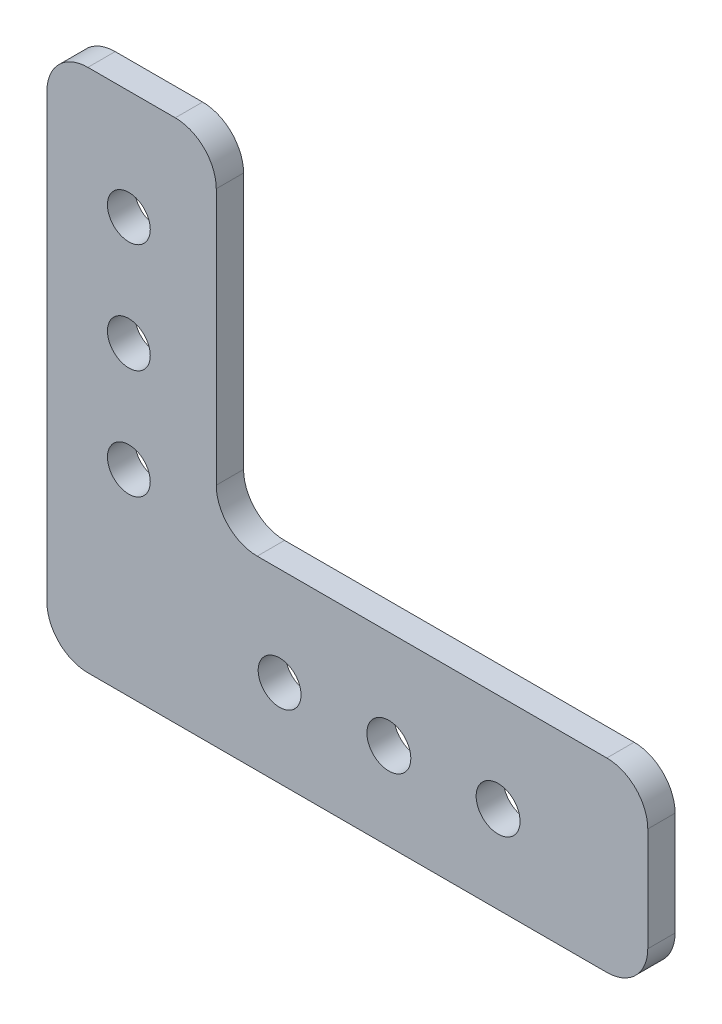
ISO-10303-21;
HEADER;
FILE_DESCRIPTION(('STEP AP214'),'2;1');
FILE_NAME('part.step','',(''),(''),'','','');
FILE_SCHEMA(('AUTOMOTIVE_DESIGN { 1 0 10303 214 1 1 1 1 }'));
ENDSEC;
DATA;
#1=APPLICATION_CONTEXT('core data for automotive mechanical design processes');
#2=APPLICATION_PROTOCOL_DEFINITION('international standard','automotive_design',2000,#1);
#3=PRODUCT_CONTEXT('',#1,'mechanical');
#4=PRODUCT('Part','Part','',(#3));
#5=PRODUCT_RELATED_PRODUCT_CATEGORY('part','',(#4));
#6=PRODUCT_DEFINITION_FORMATION('','',#4);
#7=PRODUCT_DEFINITION_CONTEXT('part definition',#1,'design');
#8=PRODUCT_DEFINITION('design','',#6,#7);
#9=PRODUCT_DEFINITION_SHAPE('','',#8);
#10=(LENGTH_UNIT() NAMED_UNIT(*) SI_UNIT(.MILLI.,.METRE.));
#11=(NAMED_UNIT(*) PLANE_ANGLE_UNIT() SI_UNIT($,.RADIAN.));
#12=(NAMED_UNIT(*) SI_UNIT($,.STERADIAN.) SOLID_ANGLE_UNIT());
#13=UNCERTAINTY_MEASURE_WITH_UNIT(LENGTH_MEASURE(1.E-05),#10,'distance_accuracy_value','');
#14=(GEOMETRIC_REPRESENTATION_CONTEXT(3) GLOBAL_UNCERTAINTY_ASSIGNED_CONTEXT((#13)) GLOBAL_UNIT_ASSIGNED_CONTEXT((#10,
#11,#12)) REPRESENTATION_CONTEXT('',''));
#15=CARTESIAN_POINT('',(0.,0.,0.));
#16=DIRECTION('',(0.,0.,1.));
#17=DIRECTION('',(1.,0.,0.));
#18=AXIS2_PLACEMENT_3D('',#15,#16,#17);
#19=CARTESIAN_POINT('',(-34.925,0.,3.175));
#20=DIRECTION('',(-1.,0.,0.));
#21=DIRECTION('',(0.,0.,1.));
#22=AXIS2_PLACEMENT_3D('',#19,#20,#21);
#23=PLANE('',#22);
#24=DIRECTION('',(0.,1.,0.));
#25=VECTOR('',#24,1.);
#26=CARTESIAN_POINT('',(-34.925,0.,3.175));
#27=LINE('',#26,#25);
#28=CARTESIAN_POINT('',(-34.925,-24.4475,3.175));
#29=VERTEX_POINT('',#28);
#30=CARTESIAN_POINT('',(-34.925,26.9875,3.175));
#31=VERTEX_POINT('',#30);
#32=EDGE_CURVE('E279',#29,#31,#27,.T.);
#33=ORIENTED_EDGE('',*,*,#32,.T.);
#34=DIRECTION('',(0.,0.,-1.));
#35=VECTOR('',#34,1.);
#36=CARTESIAN_POINT('',(-34.925,26.9875,3.175));
#37=LINE('',#36,#35);
#38=CARTESIAN_POINT('',(-34.925,26.9875,0.));
#39=VERTEX_POINT('',#38);
#40=EDGE_CURVE('E192',#31,#39,#37,.T.);
#41=ORIENTED_EDGE('',*,*,#40,.T.);
#42=DIRECTION('',(0.,1.,0.));
#43=VECTOR('',#42,1.);
#44=CARTESIAN_POINT('',(-34.925,0.,0.));
#45=LINE('',#44,#43);
#46=CARTESIAN_POINT('',(-34.925,-24.4475,0.));
#47=VERTEX_POINT('',#46);
#48=EDGE_CURVE('E315',#47,#39,#45,.T.);
#49=ORIENTED_EDGE('',*,*,#48,.F.);
#50=DIRECTION('',(0.,0.,-1.));
#51=VECTOR('',#50,1.);
#52=CARTESIAN_POINT('',(-34.925,-24.4475,3.175));
#53=LINE('',#52,#51);
#54=EDGE_CURVE('E190',#47,#29,#53,.F.);
#55=ORIENTED_EDGE('',*,*,#54,.T.);
#56=EDGE_LOOP('',(#33,#41,#49,#55));
#57=FACE_BOUND('',#56,.T.);
#58=ADVANCED_FACE('F38',(#57),#23,.T.);
#59=CARTESIAN_POINT('',(0.,-29.21,3.175));
#60=DIRECTION('',(0.,1.,0.));
#61=DIRECTION('',(0.,0.,1.));
#62=AXIS2_PLACEMENT_3D('',#59,#60,#61);
#63=PLANE('',#62);
#64=DIRECTION('',(1.,0.,0.));
#65=VECTOR('',#64,1.);
#66=CARTESIAN_POINT('',(0.,-29.21,0.));
#67=LINE('',#66,#65);
#68=CARTESIAN_POINT('',(-30.1625,-29.21,0.));
#69=VERTEX_POINT('',#68);
#70=CARTESIAN_POINT('',(30.1625,-29.21,0.));
#71=VERTEX_POINT('',#70);
#72=EDGE_CURVE('E162',#69,#71,#67,.T.);
#73=ORIENTED_EDGE('',*,*,#72,.T.);
#74=DIRECTION('',(0.,0.,-1.));
#75=VECTOR('',#74,1.);
#76=CARTESIAN_POINT('',(30.1625,-29.21,3.175));
#77=LINE('',#76,#75);
#78=CARTESIAN_POINT('',(30.1625,-29.21,3.175));
#79=VERTEX_POINT('',#78);
#80=EDGE_CURVE('E53',#71,#79,#77,.F.);
#81=ORIENTED_EDGE('',*,*,#80,.T.);
#82=DIRECTION('',(1.,0.,0.));
#83=VECTOR('',#82,1.);
#84=CARTESIAN_POINT('',(0.,-29.21,3.175));
#85=LINE('',#84,#83);
#86=CARTESIAN_POINT('',(-30.1625,-29.21,3.175));
#87=VERTEX_POINT('',#86);
#88=EDGE_CURVE('E284',#87,#79,#85,.T.);
#89=ORIENTED_EDGE('',*,*,#88,.F.);
#90=DIRECTION('',(0.,0.,-1.));
#91=VECTOR('',#90,1.);
#92=CARTESIAN_POINT('',(-30.1625,-29.21,0.));
#93=LINE('',#92,#91);
#94=EDGE_CURVE('E186',#87,#69,#93,.T.);
#95=ORIENTED_EDGE('',*,*,#94,.T.);
#96=EDGE_LOOP('',(#73,#81,#89,#95));
#97=FACE_BOUND('',#96,.T.);
#98=ADVANCED_FACE('F229',(#97),#63,.F.);
#99=CARTESIAN_POINT('',(34.925,0.,3.175));
#100=DIRECTION('',(-1.,0.,0.));
#101=DIRECTION('',(0.,0.,1.));
#102=AXIS2_PLACEMENT_3D('',#99,#100,#101);
#103=PLANE('',#102);
#104=DIRECTION('',(0.,1.,0.));
#105=VECTOR('',#104,1.);
#106=CARTESIAN_POINT('',(34.925,0.,0.));
#107=LINE('',#106,#105);
#108=CARTESIAN_POINT('',(34.925,-24.4475,0.));
#109=VERTEX_POINT('',#108);
#110=CARTESIAN_POINT('',(34.925,-12.3825,0.));
#111=VERTEX_POINT('',#110);
#112=EDGE_CURVE('E157',#109,#111,#107,.T.);
#113=ORIENTED_EDGE('',*,*,#112,.T.);
#114=DIRECTION('',(0.,0.,-1.));
#115=VECTOR('',#114,1.);
#116=CARTESIAN_POINT('',(34.925,-12.3825,3.175));
#117=LINE('',#116,#115);
#118=CARTESIAN_POINT('',(34.925,-12.3825,3.175));
#119=VERTEX_POINT('',#118);
#120=EDGE_CURVE('E133',#111,#119,#117,.F.);
#121=ORIENTED_EDGE('',*,*,#120,.T.);
#122=DIRECTION('',(0.,1.,0.));
#123=VECTOR('',#122,1.);
#124=CARTESIAN_POINT('',(34.925,0.,3.175));
#125=LINE('',#124,#123);
#126=CARTESIAN_POINT('',(34.925,-24.4475,3.175));
#127=VERTEX_POINT('',#126);
#128=EDGE_CURVE('E287',#127,#119,#125,.T.);
#129=ORIENTED_EDGE('',*,*,#128,.F.);
#130=DIRECTION('',(0.,0.,-1.));
#131=VECTOR('',#130,1.);
#132=CARTESIAN_POINT('',(34.925,-24.4475,3.175));
#133=LINE('',#132,#131);
#134=EDGE_CURVE('E138',#127,#109,#133,.T.);
#135=ORIENTED_EDGE('',*,*,#134,.T.);
#136=EDGE_LOOP('',(#113,#121,#129,#135));
#137=FACE_BOUND('',#136,.T.);
#138=ADVANCED_FACE('F235',(#137),#103,.F.);
#139=CARTESIAN_POINT('',(0.,-7.62,3.175));
#140=DIRECTION('',(0.,-1.,0.));
#141=DIRECTION('',(1.,0.,0.));
#142=AXIS2_PLACEMENT_3D('',#139,#140,#141);
#143=PLANE('',#142);
#144=DIRECTION('',(-1.,0.,0.));
#145=VECTOR('',#144,1.);
#146=CARTESIAN_POINT('',(0.,-7.62,3.175));
#147=LINE('',#146,#145);
#148=CARTESIAN_POINT('',(30.1625,-7.62,3.175));
#149=VERTEX_POINT('',#148);
#150=CARTESIAN_POINT('',(-10.4775,-7.62,3.175));
#151=VERTEX_POINT('',#150);
#152=EDGE_CURVE('E149',#149,#151,#147,.T.);
#153=ORIENTED_EDGE('',*,*,#152,.F.);
#154=DIRECTION('',(0.,0.,-1.));
#155=VECTOR('',#154,1.);
#156=CARTESIAN_POINT('',(30.1625,-7.62,3.175));
#157=LINE('',#156,#155);
#158=CARTESIAN_POINT('',(30.1625,-7.62,0.));
#159=VERTEX_POINT('',#158);
#160=EDGE_CURVE('E132',#149,#159,#157,.T.);
#161=ORIENTED_EDGE('',*,*,#160,.T.);
#162=DIRECTION('',(-1.,0.,0.));
#163=VECTOR('',#162,1.);
#164=CARTESIAN_POINT('',(0.,-7.62,0.));
#165=LINE('',#164,#163);
#166=CARTESIAN_POINT('',(-10.4775,-7.62,0.));
#167=VERTEX_POINT('',#166);
#168=EDGE_CURVE('E146',#159,#167,#165,.T.);
#169=ORIENTED_EDGE('',*,*,#168,.T.);
#170=DIRECTION('',(0.,0.,1.));
#171=VECTOR('',#170,1.);
#172=CARTESIAN_POINT('',(-10.4775,-7.62,3.175));
#173=LINE('',#172,#171);
#174=EDGE_CURVE('E151',#167,#151,#173,.T.);
#175=ORIENTED_EDGE('',*,*,#174,.T.);
#176=EDGE_LOOP('',(#153,#161,#169,#175));
#177=FACE_BOUND('',#176,.T.);
#178=ADVANCED_FACE('F144',(#177),#143,.F.);
#179=CARTESIAN_POINT('',(-25.4,-6.35,3.175));
#180=DIRECTION('',(0.,0.,-1.));
#181=DIRECTION('',(-1.,0.,0.));
#182=AXIS2_PLACEMENT_3D('',#179,#180,#181);
#183=CYLINDRICAL_SURFACE('',#182,2.4892);
#184=CARTESIAN_POINT('',(-25.4,-6.35,3.175));
#185=DIRECTION('',(0.,0.,1.));
#186=DIRECTION('',(1.,0.,0.));
#187=AXIS2_PLACEMENT_3D('',#184,#185,#186);
#188=CIRCLE('',#187,2.4892);
#189=CARTESIAN_POINT('',(-22.9108,-6.35,3.175));
#190=VERTEX_POINT('',#189);
#191=EDGE_CURVE('E285',#190,#190,#188,.T.);
#192=ORIENTED_EDGE('',*,*,#191,.T.);
#193=EDGE_LOOP('',(#192));
#194=FACE_BOUND('',#193,.T.);
#195=CARTESIAN_POINT('',(-25.4,-6.35,0.));
#196=DIRECTION('',(0.,0.,1.));
#197=DIRECTION('',(1.,0.,0.));
#198=AXIS2_PLACEMENT_3D('',#195,#196,#197);
#199=CIRCLE('',#198,2.4892);
#200=CARTESIAN_POINT('',(-22.9108,-6.35,0.));
#201=VERTEX_POINT('',#200);
#202=EDGE_CURVE('E312',#201,#201,#199,.T.);
#203=ORIENTED_EDGE('',*,*,#202,.F.);
#204=EDGE_LOOP('',(#203));
#205=FACE_BOUND('',#204,.T.);
#206=ADVANCED_FACE('F240',(#194,#205),#183,.F.);
#207=CARTESIAN_POINT('',(-25.4,6.35,3.175));
#208=DIRECTION('',(0.,0.,-1.));
#209=DIRECTION('',(-1.,0.,0.));
#210=AXIS2_PLACEMENT_3D('',#207,#208,#209);
#211=CYLINDRICAL_SURFACE('',#210,2.4892);
#212=CARTESIAN_POINT('',(-25.4,6.35,3.175));
#213=DIRECTION('',(0.,0.,1.));
#214=DIRECTION('',(1.,0.,0.));
#215=AXIS2_PLACEMENT_3D('',#212,#213,#214);
#216=CIRCLE('',#215,2.4892);
#217=CARTESIAN_POINT('',(-22.9108,6.35,3.175));
#218=VERTEX_POINT('',#217);
#219=EDGE_CURVE('E290',#218,#218,#216,.T.);
#220=ORIENTED_EDGE('',*,*,#219,.T.);
#221=EDGE_LOOP('',(#220));
#222=FACE_BOUND('',#221,.T.);
#223=CARTESIAN_POINT('',(-25.4,6.35,0.));
#224=DIRECTION('',(0.,0.,1.));
#225=DIRECTION('',(1.,0.,0.));
#226=AXIS2_PLACEMENT_3D('',#223,#224,#225);
#227=CIRCLE('',#226,2.4892);
#228=CARTESIAN_POINT('',(-22.9108,6.35,0.));
#229=VERTEX_POINT('',#228);
#230=EDGE_CURVE('E309',#229,#229,#227,.T.);
#231=ORIENTED_EDGE('',*,*,#230,.F.);
#232=EDGE_LOOP('',(#231));
#233=FACE_BOUND('',#232,.T.);
#234=ADVANCED_FACE('F243',(#222,#233),#211,.F.);
#235=CARTESIAN_POINT('',(-25.4,19.05,3.175));
#236=DIRECTION('',(0.,0.,-1.));
#237=DIRECTION('',(-1.,0.,0.));
#238=AXIS2_PLACEMENT_3D('',#235,#236,#237);
#239=CYLINDRICAL_SURFACE('',#238,2.4892);
#240=CARTESIAN_POINT('',(-25.4,19.05,3.175));
#241=DIRECTION('',(0.,0.,1.));
#242=DIRECTION('',(1.,0.,0.));
#243=AXIS2_PLACEMENT_3D('',#240,#241,#242);
#244=CIRCLE('',#243,2.4892);
#245=CARTESIAN_POINT('',(-22.9108,19.05,3.175));
#246=VERTEX_POINT('',#245);
#247=EDGE_CURVE('E482',#246,#246,#244,.T.);
#248=ORIENTED_EDGE('',*,*,#247,.T.);
#249=EDGE_LOOP('',(#248));
#250=FACE_BOUND('',#249,.T.);
#251=CARTESIAN_POINT('',(-25.4,19.05,0.));
#252=DIRECTION('',(0.,0.,1.));
#253=DIRECTION('',(1.,0.,0.));
#254=AXIS2_PLACEMENT_3D('',#251,#252,#253);
#255=CIRCLE('',#254,2.4892);
#256=CARTESIAN_POINT('',(-22.9108,19.05,0.));
#257=VERTEX_POINT('',#256);
#258=EDGE_CURVE('E306',#257,#257,#255,.T.);
#259=ORIENTED_EDGE('',*,*,#258,.F.);
#260=EDGE_LOOP('',(#259));
#261=FACE_BOUND('',#260,.T.);
#262=ADVANCED_FACE('F247',(#250,#261),#239,.F.);
#263=CARTESIAN_POINT('',(-7.874,-19.05,3.175));
#264=DIRECTION('',(0.,0.,-1.));
#265=DIRECTION('',(-1.,0.,0.));
#266=AXIS2_PLACEMENT_3D('',#263,#264,#265);
#267=CYLINDRICAL_SURFACE('',#266,2.4892);
#268=CARTESIAN_POINT('',(-7.874,-19.05,3.175));
#269=DIRECTION('',(0.,0.,1.));
#270=DIRECTION('',(1.,0.,0.));
#271=AXIS2_PLACEMENT_3D('',#268,#269,#270);
#272=CIRCLE('',#271,2.4892);
#273=CARTESIAN_POINT('',(-5.3848,-19.05,3.175));
#274=VERTEX_POINT('',#273);
#275=EDGE_CURVE('E479',#274,#274,#272,.T.);
#276=ORIENTED_EDGE('',*,*,#275,.T.);
#277=EDGE_LOOP('',(#276));
#278=FACE_BOUND('',#277,.T.);
#279=CARTESIAN_POINT('',(-7.874,-19.05,0.));
#280=DIRECTION('',(0.,0.,1.));
#281=DIRECTION('',(1.,0.,0.));
#282=AXIS2_PLACEMENT_3D('',#279,#280,#281);
#283=CIRCLE('',#282,2.4892);
#284=CARTESIAN_POINT('',(-5.3848,-19.05,0.));
#285=VERTEX_POINT('',#284);
#286=EDGE_CURVE('E303',#285,#285,#283,.T.);
#287=ORIENTED_EDGE('',*,*,#286,.F.);
#288=EDGE_LOOP('',(#287));
#289=FACE_BOUND('',#288,.T.);
#290=ADVANCED_FACE('F251',(#278,#289),#267,.F.);
#291=CARTESIAN_POINT('',(4.826,-19.05,3.175));
#292=DIRECTION('',(0.,0.,-1.));
#293=DIRECTION('',(-1.,0.,0.));
#294=AXIS2_PLACEMENT_3D('',#291,#292,#293);
#295=CYLINDRICAL_SURFACE('',#294,2.5527);
#296=CARTESIAN_POINT('',(4.826,-19.05,3.175));
#297=DIRECTION('',(0.,0.,1.));
#298=DIRECTION('',(1.,0.,0.));
#299=AXIS2_PLACEMENT_3D('',#296,#297,#298);
#300=CIRCLE('',#299,2.5527);
#301=CARTESIAN_POINT('',(7.3787,-19.05,3.175));
#302=VERTEX_POINT('',#301);
#303=EDGE_CURVE('E476',#302,#302,#300,.T.);
#304=ORIENTED_EDGE('',*,*,#303,.T.);
#305=EDGE_LOOP('',(#304));
#306=FACE_BOUND('',#305,.T.);
#307=CARTESIAN_POINT('',(4.826,-19.05,0.));
#308=DIRECTION('',(0.,0.,1.));
#309=DIRECTION('',(1.,0.,0.));
#310=AXIS2_PLACEMENT_3D('',#307,#308,#309);
#311=CIRCLE('',#310,2.5527);
#312=CARTESIAN_POINT('',(7.3787,-19.05,0.));
#313=VERTEX_POINT('',#312);
#314=EDGE_CURVE('E300',#313,#313,#311,.T.);
#315=ORIENTED_EDGE('',*,*,#314,.F.);
#316=EDGE_LOOP('',(#315));
#317=FACE_BOUND('',#316,.T.);
#318=ADVANCED_FACE('F255',(#306,#317),#295,.F.);
#319=CARTESIAN_POINT('',(17.526,-19.05,3.175));
#320=DIRECTION('',(0.,0.,-1.));
#321=DIRECTION('',(-1.,0.,0.));
#322=AXIS2_PLACEMENT_3D('',#319,#320,#321);
#323=CYLINDRICAL_SURFACE('',#322,2.5527);
#324=CARTESIAN_POINT('',(17.526,-19.05,3.175));
#325=DIRECTION('',(0.,0.,1.));
#326=DIRECTION('',(1.,0.,0.));
#327=AXIS2_PLACEMENT_3D('',#324,#325,#326);
#328=CIRCLE('',#327,2.5527);
#329=CARTESIAN_POINT('',(20.0787,-19.05,3.175));
#330=VERTEX_POINT('',#329);
#331=EDGE_CURVE('E160',#330,#330,#328,.T.);
#332=ORIENTED_EDGE('',*,*,#331,.T.);
#333=EDGE_LOOP('',(#332));
#334=FACE_BOUND('',#333,.T.);
#335=CARTESIAN_POINT('',(17.526,-19.05,0.));
#336=DIRECTION('',(0.,0.,1.));
#337=DIRECTION('',(1.,0.,0.));
#338=AXIS2_PLACEMENT_3D('',#335,#336,#337);
#339=CIRCLE('',#338,2.5527);
#340=CARTESIAN_POINT('',(20.0787,-19.05,0.));
#341=VERTEX_POINT('',#340);
#342=EDGE_CURVE('E297',#341,#341,#339,.T.);
#343=ORIENTED_EDGE('',*,*,#342,.F.);
#344=EDGE_LOOP('',(#343));
#345=FACE_BOUND('',#344,.T.);
#346=ADVANCED_FACE('F259',(#334,#345),#323,.F.);
#347=CARTESIAN_POINT('',(0.,31.75,3.175));
#348=DIRECTION('',(0.,1.,0.));
#349=DIRECTION('',(-1.,0.,0.));
#350=AXIS2_PLACEMENT_3D('',#347,#348,#349);
#351=PLANE('',#350);
#352=DIRECTION('',(1.,0.,0.));
#353=VECTOR('',#352,1.);
#354=CARTESIAN_POINT('',(0.,31.75,0.));
#355=LINE('',#354,#353);
#356=CARTESIAN_POINT('',(-30.1625,31.75,0.));
#357=VERTEX_POINT('',#356);
#358=CARTESIAN_POINT('',(-20.0025,31.75,0.));
#359=VERTEX_POINT('',#358);
#360=EDGE_CURVE('E156',#357,#359,#355,.T.);
#361=ORIENTED_EDGE('',*,*,#360,.F.);
#362=DIRECTION('',(0.,0.,-1.));
#363=VECTOR('',#362,1.);
#364=CARTESIAN_POINT('',(-30.1625,31.75,3.175));
#365=LINE('',#364,#363);
#366=CARTESIAN_POINT('',(-30.1625,31.75,3.175));
#367=VERTEX_POINT('',#366);
#368=EDGE_CURVE('E197',#357,#367,#365,.F.);
#369=ORIENTED_EDGE('',*,*,#368,.T.);
#370=DIRECTION('',(1.,0.,0.));
#371=VECTOR('',#370,1.);
#372=CARTESIAN_POINT('',(0.,31.75,3.175));
#373=LINE('',#372,#371);
#374=CARTESIAN_POINT('',(-20.0025,31.75,3.175));
#375=VERTEX_POINT('',#374);
#376=EDGE_CURVE('E166',#367,#375,#373,.T.);
#377=ORIENTED_EDGE('',*,*,#376,.T.);
#378=DIRECTION('',(0.,0.,1.));
#379=VECTOR('',#378,1.);
#380=CARTESIAN_POINT('',(-20.0025,31.75,0.));
#381=LINE('',#380,#379);
#382=EDGE_CURVE('E195',#375,#359,#381,.F.);
#383=ORIENTED_EDGE('',*,*,#382,.T.);
#384=EDGE_LOOP('',(#361,#369,#377,#383));
#385=FACE_BOUND('',#384,.T.);
#386=ADVANCED_FACE('F263',(#385),#351,.T.);
#387=CARTESIAN_POINT('',(0.,0.,3.175));
#388=DIRECTION('',(0.,0.,1.));
#389=DIRECTION('',(1.,0.,0.));
#390=AXIS2_PLACEMENT_3D('',#387,#388,#389);
#391=PLANE('',#390);
#392=ORIENTED_EDGE('',*,*,#128,.T.);
#393=CARTESIAN_POINT('',(30.1625,-12.3825,3.175));
#394=DIRECTION('',(0.,0.,1.));
#395=DIRECTION('',(1.,0.,0.));
#396=AXIS2_PLACEMENT_3D('',#393,#394,#395);
#397=CIRCLE('',#396,4.7625);
#398=EDGE_CURVE('E184',#119,#149,#397,.T.);
#399=ORIENTED_EDGE('',*,*,#398,.T.);
#400=ORIENTED_EDGE('',*,*,#152,.T.);
#401=CARTESIAN_POINT('',(-10.4775,-2.8575,3.175));
#402=DIRECTION('',(0.,0.,1.));
#403=DIRECTION('',(1.,0.,0.));
#404=AXIS2_PLACEMENT_3D('',#401,#402,#403);
#405=CIRCLE('',#404,4.7625);
#406=CARTESIAN_POINT('',(-15.24,-2.8575,3.175));
#407=VERTEX_POINT('',#406);
#408=EDGE_CURVE('E46',#151,#407,#405,.F.);
#409=ORIENTED_EDGE('',*,*,#408,.T.);
#410=DIRECTION('',(0.,-1.,0.));
#411=VECTOR('',#410,1.);
#412=CARTESIAN_POINT('',(-15.24,31.75,3.175));
#413=LINE('',#412,#411);
#414=CARTESIAN_POINT('',(-15.24,26.9875,3.175));
#415=VERTEX_POINT('',#414);
#416=EDGE_CURVE('E208',#415,#407,#413,.T.);
#417=ORIENTED_EDGE('',*,*,#416,.F.);
#418=CARTESIAN_POINT('',(-20.0025,26.9875,3.175));
#419=DIRECTION('',(0.,0.,1.));
#420=DIRECTION('',(1.,0.,0.));
#421=AXIS2_PLACEMENT_3D('',#418,#419,#420);
#422=CIRCLE('',#421,4.7625);
#423=EDGE_CURVE('E178',#415,#375,#422,.T.);
#424=ORIENTED_EDGE('',*,*,#423,.T.);
#425=ORIENTED_EDGE('',*,*,#376,.F.);
#426=CARTESIAN_POINT('',(-30.1625,26.9875,3.175));
#427=DIRECTION('',(0.,0.,1.));
#428=DIRECTION('',(1.,0.,0.));
#429=AXIS2_PLACEMENT_3D('',#426,#427,#428);
#430=CIRCLE('',#429,4.7625);
#431=EDGE_CURVE('E180',#367,#31,#430,.T.);
#432=ORIENTED_EDGE('',*,*,#431,.T.);
#433=ORIENTED_EDGE('',*,*,#32,.F.);
#434=CARTESIAN_POINT('',(-30.1625,-24.4475,3.175));
#435=DIRECTION('',(0.,0.,1.));
#436=DIRECTION('',(1.,0.,0.));
#437=AXIS2_PLACEMENT_3D('',#434,#435,#436);
#438=CIRCLE('',#437,4.7625);
#439=EDGE_CURVE('E60',#29,#87,#438,.T.);
#440=ORIENTED_EDGE('',*,*,#439,.T.);
#441=ORIENTED_EDGE('',*,*,#88,.T.);
#442=CARTESIAN_POINT('',(30.1625,-24.4475,3.175));
#443=DIRECTION('',(0.,0.,1.));
#444=DIRECTION('',(1.,0.,0.));
#445=AXIS2_PLACEMENT_3D('',#442,#443,#444);
#446=CIRCLE('',#445,4.7625);
#447=EDGE_CURVE('E182',#79,#127,#446,.T.);
#448=ORIENTED_EDGE('',*,*,#447,.T.);
#449=EDGE_LOOP('',(#392,#399,#400,#409,#417,#424,#425,#432,#433,#440,#441,#448));
#450=FACE_BOUND('',#449,.T.);
#451=ORIENTED_EDGE('',*,*,#331,.F.);
#452=EDGE_LOOP('',(#451));
#453=FACE_BOUND('',#452,.T.);
#454=ORIENTED_EDGE('',*,*,#303,.F.);
#455=EDGE_LOOP('',(#454));
#456=FACE_BOUND('',#455,.T.);
#457=ORIENTED_EDGE('',*,*,#275,.F.);
#458=EDGE_LOOP('',(#457));
#459=FACE_BOUND('',#458,.T.);
#460=ORIENTED_EDGE('',*,*,#247,.F.);
#461=EDGE_LOOP('',(#460));
#462=FACE_BOUND('',#461,.T.);
#463=ORIENTED_EDGE('',*,*,#219,.F.);
#464=EDGE_LOOP('',(#463));
#465=FACE_BOUND('',#464,.T.);
#466=ORIENTED_EDGE('',*,*,#191,.F.);
#467=EDGE_LOOP('',(#466));
#468=FACE_BOUND('',#467,.T.);
#469=ADVANCED_FACE('F206',(#450,#453,#456,#459,#462,#465,#468),#391,.T.);
#470=CARTESIAN_POINT('',(0.,0.,0.));
#471=DIRECTION('',(0.,0.,1.));
#472=DIRECTION('',(1.,0.,0.));
#473=AXIS2_PLACEMENT_3D('',#470,#471,#472);
#474=PLANE('',#473);
#475=ORIENTED_EDGE('',*,*,#342,.T.);
#476=EDGE_LOOP('',(#475));
#477=FACE_BOUND('',#476,.T.);
#478=ORIENTED_EDGE('',*,*,#314,.T.);
#479=EDGE_LOOP('',(#478));
#480=FACE_BOUND('',#479,.T.);
#481=ORIENTED_EDGE('',*,*,#286,.T.);
#482=EDGE_LOOP('',(#481));
#483=FACE_BOUND('',#482,.T.);
#484=ORIENTED_EDGE('',*,*,#258,.T.);
#485=EDGE_LOOP('',(#484));
#486=FACE_BOUND('',#485,.T.);
#487=ORIENTED_EDGE('',*,*,#230,.T.);
#488=EDGE_LOOP('',(#487));
#489=FACE_BOUND('',#488,.T.);
#490=ORIENTED_EDGE('',*,*,#202,.T.);
#491=EDGE_LOOP('',(#490));
#492=FACE_BOUND('',#491,.T.);
#493=ORIENTED_EDGE('',*,*,#168,.F.);
#494=CARTESIAN_POINT('',(30.1625,-12.3825,0.));
#495=DIRECTION('',(0.,0.,1.));
#496=DIRECTION('',(1.,0.,0.));
#497=AXIS2_PLACEMENT_3D('',#494,#495,#496);
#498=CIRCLE('',#497,4.7625);
#499=EDGE_CURVE('E128',#159,#111,#498,.F.);
#500=ORIENTED_EDGE('',*,*,#499,.T.);
#501=ORIENTED_EDGE('',*,*,#112,.F.);
#502=CARTESIAN_POINT('',(30.1625,-24.4475,0.));
#503=DIRECTION('',(0.,0.,1.));
#504=DIRECTION('',(1.,0.,0.));
#505=AXIS2_PLACEMENT_3D('',#502,#503,#504);
#506=CIRCLE('',#505,4.7625);
#507=EDGE_CURVE('E139',#109,#71,#506,.F.);
#508=ORIENTED_EDGE('',*,*,#507,.T.);
#509=ORIENTED_EDGE('',*,*,#72,.F.);
#510=CARTESIAN_POINT('',(-30.1625,-24.4475,0.));
#511=DIRECTION('',(0.,0.,1.));
#512=DIRECTION('',(1.,0.,0.));
#513=AXIS2_PLACEMENT_3D('',#510,#511,#512);
#514=CIRCLE('',#513,4.7625);
#515=EDGE_CURVE('E150',#69,#47,#514,.F.);
#516=ORIENTED_EDGE('',*,*,#515,.T.);
#517=ORIENTED_EDGE('',*,*,#48,.T.);
#518=CARTESIAN_POINT('',(-30.1625,26.9875,0.));
#519=DIRECTION('',(0.,0.,1.));
#520=DIRECTION('',(1.,0.,0.));
#521=AXIS2_PLACEMENT_3D('',#518,#519,#520);
#522=CIRCLE('',#521,4.7625);
#523=EDGE_CURVE('E171',#39,#357,#522,.F.);
#524=ORIENTED_EDGE('',*,*,#523,.T.);
#525=ORIENTED_EDGE('',*,*,#360,.T.);
#526=CARTESIAN_POINT('',(-20.0025,26.9875,0.));
#527=DIRECTION('',(0.,0.,1.));
#528=DIRECTION('',(1.,0.,0.));
#529=AXIS2_PLACEMENT_3D('',#526,#527,#528);
#530=CIRCLE('',#529,4.7625);
#531=CARTESIAN_POINT('',(-15.24,26.9875,0.));
#532=VERTEX_POINT('',#531);
#533=EDGE_CURVE('E169',#359,#532,#530,.F.);
#534=ORIENTED_EDGE('',*,*,#533,.T.);
#535=DIRECTION('',(0.,-1.,0.));
#536=VECTOR('',#535,1.);
#537=CARTESIAN_POINT('',(-15.24,31.75,0.));
#538=LINE('',#537,#536);
#539=CARTESIAN_POINT('',(-15.24,-2.8575,0.));
#540=VERTEX_POINT('',#539);
#541=EDGE_CURVE('E215',#532,#540,#538,.T.);
#542=ORIENTED_EDGE('',*,*,#541,.T.);
#543=CARTESIAN_POINT('',(-10.4775,-2.8575,0.));
#544=DIRECTION('',(0.,0.,1.));
#545=DIRECTION('',(1.,0.,0.));
#546=AXIS2_PLACEMENT_3D('',#543,#544,#545);
#547=CIRCLE('',#546,4.7625);
#548=EDGE_CURVE('E11',#540,#167,#547,.T.);
#549=ORIENTED_EDGE('',*,*,#548,.T.);
#550=EDGE_LOOP('',(#493,#500,#501,#508,#509,#516,#517,#524,#525,#534,#542,#549));
#551=FACE_BOUND('',#550,.T.);
#552=ADVANCED_FACE('F153',(#477,#480,#483,#486,#489,#492,#551),#474,.F.);
#553=CARTESIAN_POINT('',(-15.24,31.75,0.));
#554=DIRECTION('',(-1.,0.,0.));
#555=DIRECTION('',(0.,-1.,0.));
#556=AXIS2_PLACEMENT_3D('',#553,#554,#555);
#557=PLANE('',#556);
#558=ORIENTED_EDGE('',*,*,#541,.F.);
#559=DIRECTION('',(0.,0.,1.));
#560=VECTOR('',#559,1.);
#561=CARTESIAN_POINT('',(-15.24,26.9875,3.175));
#562=LINE('',#561,#560);
#563=EDGE_CURVE('E201',#532,#415,#562,.T.);
#564=ORIENTED_EDGE('',*,*,#563,.T.);
#565=ORIENTED_EDGE('',*,*,#416,.T.);
#566=DIRECTION('',(0.,0.,1.));
#567=VECTOR('',#566,1.);
#568=CARTESIAN_POINT('',(-15.24,-2.8575,0.));
#569=LINE('',#568,#567);
#570=EDGE_CURVE('E199',#407,#540,#569,.F.);
#571=ORIENTED_EDGE('',*,*,#570,.T.);
#572=EDGE_LOOP('',(#558,#564,#565,#571));
#573=FACE_BOUND('',#572,.T.);
#574=ADVANCED_FACE('F213',(#573),#557,.F.);
#575=CARTESIAN_POINT('',(30.1625,-12.3825,3.175));
#576=DIRECTION('',(0.,0.,-1.));
#577=DIRECTION('',(-1.,0.,0.));
#578=AXIS2_PLACEMENT_3D('',#575,#576,#577);
#579=CYLINDRICAL_SURFACE('',#578,4.7625);
#580=ORIENTED_EDGE('',*,*,#398,.F.);
#581=ORIENTED_EDGE('',*,*,#120,.F.);
#582=ORIENTED_EDGE('',*,*,#499,.F.);
#583=ORIENTED_EDGE('',*,*,#160,.F.);
#584=EDGE_LOOP('',(#580,#581,#582,#583));
#585=FACE_BOUND('',#584,.T.);
#586=ADVANCED_FACE('F131',(#585),#579,.T.);
#587=CARTESIAN_POINT('',(30.1625,-24.4475,3.175));
#588=DIRECTION('',(0.,0.,-1.));
#589=DIRECTION('',(-1.,0.,0.));
#590=AXIS2_PLACEMENT_3D('',#587,#588,#589);
#591=CYLINDRICAL_SURFACE('',#590,4.7625);
#592=ORIENTED_EDGE('',*,*,#447,.F.);
#593=ORIENTED_EDGE('',*,*,#80,.F.);
#594=ORIENTED_EDGE('',*,*,#507,.F.);
#595=ORIENTED_EDGE('',*,*,#134,.F.);
#596=EDGE_LOOP('',(#592,#593,#594,#595));
#597=FACE_BOUND('',#596,.T.);
#598=ADVANCED_FACE('F267',(#597),#591,.T.);
#599=CARTESIAN_POINT('',(-30.1625,26.9875,3.175));
#600=DIRECTION('',(0.,0.,-1.));
#601=DIRECTION('',(-1.,0.,0.));
#602=AXIS2_PLACEMENT_3D('',#599,#600,#601);
#603=CYLINDRICAL_SURFACE('',#602,4.7625);
#604=ORIENTED_EDGE('',*,*,#431,.F.);
#605=ORIENTED_EDGE('',*,*,#368,.F.);
#606=ORIENTED_EDGE('',*,*,#523,.F.);
#607=ORIENTED_EDGE('',*,*,#40,.F.);
#608=EDGE_LOOP('',(#604,#605,#606,#607));
#609=FACE_BOUND('',#608,.T.);
#610=ADVANCED_FACE('F225',(#609),#603,.T.);
#611=CARTESIAN_POINT('',(-20.0025,26.9875,0.));
#612=DIRECTION('',(0.,0.,-1.));
#613=DIRECTION('',(-1.,0.,0.));
#614=AXIS2_PLACEMENT_3D('',#611,#612,#613);
#615=CYLINDRICAL_SURFACE('',#614,4.7625);
#616=ORIENTED_EDGE('',*,*,#533,.F.);
#617=ORIENTED_EDGE('',*,*,#382,.F.);
#618=ORIENTED_EDGE('',*,*,#423,.F.);
#619=ORIENTED_EDGE('',*,*,#563,.F.);
#620=EDGE_LOOP('',(#616,#617,#618,#619));
#621=FACE_BOUND('',#620,.T.);
#622=ADVANCED_FACE('F219',(#621),#615,.T.);
#623=CARTESIAN_POINT('',(-10.4775,-2.8575,3.175));
#624=DIRECTION('',(0.,0.,-1.));
#625=DIRECTION('',(-1.,0.,0.));
#626=AXIS2_PLACEMENT_3D('',#623,#624,#625);
#627=CYLINDRICAL_SURFACE('',#626,4.7625);
#628=ORIENTED_EDGE('',*,*,#548,.F.);
#629=ORIENTED_EDGE('',*,*,#570,.F.);
#630=ORIENTED_EDGE('',*,*,#408,.F.);
#631=ORIENTED_EDGE('',*,*,#174,.F.);
#632=EDGE_LOOP('',(#628,#629,#630,#631));
#633=FACE_BOUND('',#632,.T.);
#634=ADVANCED_FACE('F217',(#633),#627,.F.);
#635=CARTESIAN_POINT('',(-30.1625,-24.4475,3.175));
#636=DIRECTION('',(0.,0.,1.));
#637=DIRECTION('',(1.,0.,0.));
#638=AXIS2_PLACEMENT_3D('',#635,#636,#637);
#639=CYLINDRICAL_SURFACE('',#638,4.7625);
#640=ORIENTED_EDGE('',*,*,#439,.F.);
#641=ORIENTED_EDGE('',*,*,#54,.F.);
#642=ORIENTED_EDGE('',*,*,#515,.F.);
#643=ORIENTED_EDGE('',*,*,#94,.F.);
#644=EDGE_LOOP('',(#640,#641,#642,#643));
#645=FACE_BOUND('',#644,.T.);
#646=ADVANCED_FACE('F40',(#645),#639,.T.);
#647=CLOSED_SHELL('',(#58,#98,#138,#178,#206,#234,#262,#290,#318,#346,#386,#469,#552,#574,#586,
#598,#610,#622,#634,#646));
#648=MANIFOLD_SOLID_BREP('B2',#647);
#649=ADVANCED_BREP_SHAPE_REPRESENTATION('',(#18,#648),#14);
#650=SHAPE_DEFINITION_REPRESENTATION(#9,#649);
ENDSEC;
END-ISO-10303-21;
